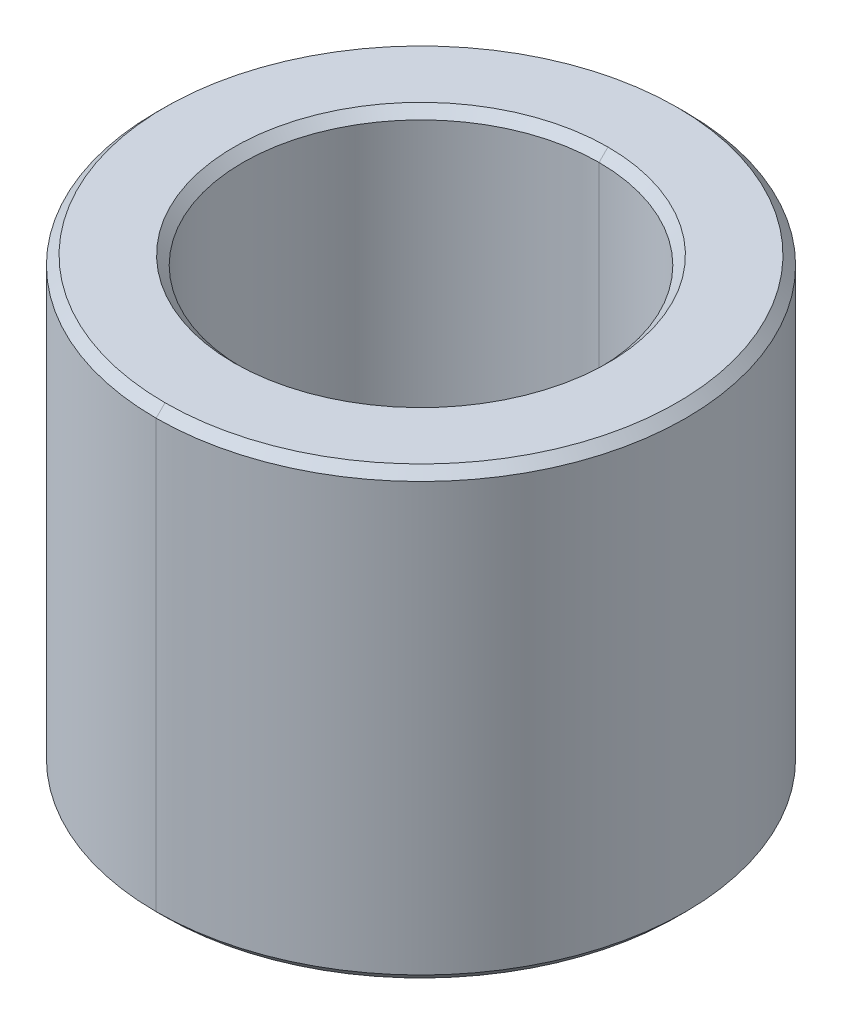
ISO-10303-21;
HEADER;
FILE_DESCRIPTION(('STEP AP214'),'2;1');
FILE_NAME('part.step','',(''),(''),'','','');
FILE_SCHEMA(('AUTOMOTIVE_DESIGN { 1 0 10303 214 1 1 1 1 }'));
ENDSEC;
DATA;
#1=APPLICATION_CONTEXT('core data for automotive mechanical design processes');
#2=APPLICATION_PROTOCOL_DEFINITION('international standard','automotive_design',2000,#1);
#3=PRODUCT_CONTEXT('',#1,'mechanical');
#4=PRODUCT('Part','Part','',(#3));
#5=PRODUCT_RELATED_PRODUCT_CATEGORY('part','',(#4));
#6=PRODUCT_DEFINITION_FORMATION('','',#4);
#7=PRODUCT_DEFINITION_CONTEXT('part definition',#1,'design');
#8=PRODUCT_DEFINITION('design','',#6,#7);
#9=PRODUCT_DEFINITION_SHAPE('','',#8);
#10=(LENGTH_UNIT() NAMED_UNIT(*) SI_UNIT(.MILLI.,.METRE.));
#11=(NAMED_UNIT(*) PLANE_ANGLE_UNIT() SI_UNIT($,.RADIAN.));
#12=(NAMED_UNIT(*) SI_UNIT($,.STERADIAN.) SOLID_ANGLE_UNIT());
#13=UNCERTAINTY_MEASURE_WITH_UNIT(LENGTH_MEASURE(1.E-05),#10,'distance_accuracy_value','');
#14=(GEOMETRIC_REPRESENTATION_CONTEXT(3) GLOBAL_UNCERTAINTY_ASSIGNED_CONTEXT((#13)) GLOBAL_UNIT_ASSIGNED_CONTEXT((#10,
#11,#12)) REPRESENTATION_CONTEXT('',''));
#15=CARTESIAN_POINT('',(0.,0.,0.));
#16=DIRECTION('',(0.,0.,1.));
#17=DIRECTION('',(1.,0.,0.));
#18=AXIS2_PLACEMENT_3D('',#15,#16,#17);
#19=CARTESIAN_POINT('',(0.,2.4,0.));
#20=DIRECTION('',(0.,1.,0.));
#21=DIRECTION('',(0.,0.,1.));
#22=AXIS2_PLACEMENT_3D('',#19,#20,#21);
#23=CONICAL_SURFACE('',#22,2.,0.78539816339745);
#24=DIRECTION('',(0.,0.707106781186546,-0.707106781186549));
#25=VECTOR('',#24,1.);
#26=CARTESIAN_POINT('',(0.,2.4,-2.));
#27=LINE('',#26,#25);
#28=CARTESIAN_POINT('',(0.,2.4,-2.));
#29=VERTEX_POINT('',#28);
#30=CARTESIAN_POINT('',(0.,2.5,-2.1));
#31=VERTEX_POINT('',#30);
#32=EDGE_CURVE('E134',#29,#31,#27,.T.);
#33=ORIENTED_EDGE('',*,*,#32,.F.);
#34=CARTESIAN_POINT('',(0.,2.4,0.));
#35=DIRECTION('',(0.,1.,0.));
#36=DIRECTION('',(0.,0.,1.));
#37=AXIS2_PLACEMENT_3D('',#34,#35,#36);
#38=CIRCLE('',#37,2.);
#39=CARTESIAN_POINT('',(0.,2.4,2.));
#40=VERTEX_POINT('',#39);
#41=EDGE_CURVE('E25',#40,#29,#38,.T.);
#42=ORIENTED_EDGE('',*,*,#41,.F.);
#43=DIRECTION('',(0.,0.707106781186546,0.707106781186549));
#44=VECTOR('',#43,1.);
#45=CARTESIAN_POINT('',(0.,2.4,2.));
#46=LINE('',#45,#44);
#47=CARTESIAN_POINT('',(0.,2.5,2.1));
#48=VERTEX_POINT('',#47);
#49=EDGE_CURVE('E125',#40,#48,#46,.T.);
#50=ORIENTED_EDGE('',*,*,#49,.T.);
#51=CARTESIAN_POINT('',(0.,2.5,0.));
#52=DIRECTION('',(0.,-1.,0.));
#53=DIRECTION('',(0.,0.,1.));
#54=AXIS2_PLACEMENT_3D('',#51,#52,#53);
#55=CIRCLE('',#54,2.1);
#56=EDGE_CURVE('E128',#31,#48,#55,.T.);
#57=ORIENTED_EDGE('',*,*,#56,.F.);
#58=EDGE_LOOP('',(#33,#42,#50,#57));
#59=FACE_BOUND('',#58,.T.);
#60=ADVANCED_FACE('F14',(#59),#23,.F.);
#61=CARTESIAN_POINT('',(0.,-2.5,0.));
#62=DIRECTION('',(0.,-1.,0.));
#63=DIRECTION('',(0.,0.,-1.));
#64=AXIS2_PLACEMENT_3D('',#61,#62,#63);
#65=CONICAL_SURFACE('',#64,2.1,0.78539816339744);
#66=DIRECTION('',(0.,-0.707106781186554,0.707106781186542));
#67=VECTOR('',#66,1.);
#68=CARTESIAN_POINT('',(0.,-2.5,2.1));
#69=LINE('',#68,#67);
#70=CARTESIAN_POINT('',(0.,-2.4,2.));
#71=VERTEX_POINT('',#70);
#72=CARTESIAN_POINT('',(0.,-2.5,2.1));
#73=VERTEX_POINT('',#72);
#74=EDGE_CURVE('E101',#71,#73,#69,.T.);
#75=ORIENTED_EDGE('',*,*,#74,.F.);
#76=CARTESIAN_POINT('',(0.,-2.4,0.));
#77=DIRECTION('',(0.,-1.,0.));
#78=DIRECTION('',(0.,0.,1.));
#79=AXIS2_PLACEMENT_3D('',#76,#77,#78);
#80=CIRCLE('',#79,2.);
#81=CARTESIAN_POINT('',(0.,-2.4,-2.));
#82=VERTEX_POINT('',#81);
#83=EDGE_CURVE('E9',#82,#71,#80,.T.);
#84=ORIENTED_EDGE('',*,*,#83,.F.);
#85=DIRECTION('',(0.,-0.707106781186554,-0.707106781186542));
#86=VECTOR('',#85,1.);
#87=CARTESIAN_POINT('',(0.,-2.5,-2.1));
#88=LINE('',#87,#86);
#89=CARTESIAN_POINT('',(0.,-2.5,-2.1));
#90=VERTEX_POINT('',#89);
#91=EDGE_CURVE('E104',#82,#90,#88,.T.);
#92=ORIENTED_EDGE('',*,*,#91,.T.);
#93=CARTESIAN_POINT('',(0.,-2.5,0.));
#94=DIRECTION('',(0.,1.,0.));
#95=DIRECTION('',(0.,0.,1.));
#96=AXIS2_PLACEMENT_3D('',#93,#94,#95);
#97=CIRCLE('',#96,2.1);
#98=EDGE_CURVE('E97',#73,#90,#97,.T.);
#99=ORIENTED_EDGE('',*,*,#98,.F.);
#100=EDGE_LOOP('',(#75,#84,#92,#99));
#101=FACE_BOUND('',#100,.T.);
#102=ADVANCED_FACE('F99',(#101),#65,.F.);
#103=CARTESIAN_POINT('',(0.,2.5,0.));
#104=DIRECTION('',(0.,-1.,0.));
#105=DIRECTION('',(0.,0.,-1.));
#106=AXIS2_PLACEMENT_3D('',#103,#104,#105);
#107=CONICAL_SURFACE('',#106,2.875,0.78539816339744);
#108=DIRECTION('',(0.,-0.707106781186554,0.707106781186542));
#109=VECTOR('',#108,1.);
#110=CARTESIAN_POINT('',(0.,2.5,2.875));
#111=LINE('',#110,#109);
#112=CARTESIAN_POINT('',(0.,2.5,2.875));
#113=VERTEX_POINT('',#112);
#114=CARTESIAN_POINT('',(0.,2.4,2.975));
#115=VERTEX_POINT('',#114);
#116=EDGE_CURVE('E151',#113,#115,#111,.T.);
#117=ORIENTED_EDGE('',*,*,#116,.F.);
#118=CARTESIAN_POINT('',(0.,2.5,0.));
#119=DIRECTION('',(0.,1.,0.));
#120=DIRECTION('',(0.,0.,1.));
#121=AXIS2_PLACEMENT_3D('',#118,#119,#120);
#122=CIRCLE('',#121,2.875);
#123=CARTESIAN_POINT('',(0.,2.5,-2.875));
#124=VERTEX_POINT('',#123);
#125=EDGE_CURVE('E144',#124,#113,#122,.T.);
#126=ORIENTED_EDGE('',*,*,#125,.F.);
#127=DIRECTION('',(0.,-0.707106781186554,-0.707106781186542));
#128=VECTOR('',#127,1.);
#129=CARTESIAN_POINT('',(0.,2.5,-2.875));
#130=LINE('',#129,#128);
#131=CARTESIAN_POINT('',(0.,2.4,-2.975));
#132=VERTEX_POINT('',#131);
#133=EDGE_CURVE('E154',#124,#132,#130,.T.);
#134=ORIENTED_EDGE('',*,*,#133,.T.);
#135=CARTESIAN_POINT('',(0.,2.4,0.));
#136=DIRECTION('',(0.,-1.,0.));
#137=DIRECTION('',(0.,0.,1.));
#138=AXIS2_PLACEMENT_3D('',#135,#136,#137);
#139=CIRCLE('',#138,2.975);
#140=EDGE_CURVE('E108',#115,#132,#139,.T.);
#141=ORIENTED_EDGE('',*,*,#140,.F.);
#142=EDGE_LOOP('',(#117,#126,#134,#141));
#143=FACE_BOUND('',#142,.T.);
#144=ADVANCED_FACE('F223',(#143),#107,.T.);
#145=CARTESIAN_POINT('',(0.,-2.4,0.));
#146=DIRECTION('',(0.,1.,0.));
#147=DIRECTION('',(0.,0.,1.));
#148=AXIS2_PLACEMENT_3D('',#145,#146,#147);
#149=CONICAL_SURFACE('',#148,2.975,0.785398163397446);
#150=DIRECTION('',(0.,0.707106781186549,-0.707106781186546));
#151=VECTOR('',#150,1.);
#152=CARTESIAN_POINT('',(0.,-2.4,-2.975));
#153=LINE('',#152,#151);
#154=CARTESIAN_POINT('',(0.,-2.5,-2.875));
#155=VERTEX_POINT('',#154);
#156=CARTESIAN_POINT('',(0.,-2.4,-2.975));
#157=VERTEX_POINT('',#156);
#158=EDGE_CURVE('E184',#155,#157,#153,.T.);
#159=ORIENTED_EDGE('',*,*,#158,.F.);
#160=CARTESIAN_POINT('',(0.,-2.5,0.));
#161=DIRECTION('',(0.,-1.,0.));
#162=DIRECTION('',(0.,0.,1.));
#163=AXIS2_PLACEMENT_3D('',#160,#161,#162);
#164=CIRCLE('',#163,2.875);
#165=CARTESIAN_POINT('',(0.,-2.5,2.875));
#166=VERTEX_POINT('',#165);
#167=EDGE_CURVE('E109',#166,#155,#164,.T.);
#168=ORIENTED_EDGE('',*,*,#167,.F.);
#169=DIRECTION('',(0.,0.707106781186549,0.707106781186546));
#170=VECTOR('',#169,1.);
#171=CARTESIAN_POINT('',(0.,-2.4,2.975));
#172=LINE('',#171,#170);
#173=CARTESIAN_POINT('',(0.,-2.4,2.975));
#174=VERTEX_POINT('',#173);
#175=EDGE_CURVE('E173',#166,#174,#172,.T.);
#176=ORIENTED_EDGE('',*,*,#175,.T.);
#177=CARTESIAN_POINT('',(0.,-2.4,0.));
#178=DIRECTION('',(0.,1.,0.));
#179=DIRECTION('',(0.,0.,1.));
#180=AXIS2_PLACEMENT_3D('',#177,#178,#179);
#181=CIRCLE('',#180,2.975);
#182=EDGE_CURVE('E40',#157,#174,#181,.T.);
#183=ORIENTED_EDGE('',*,*,#182,.F.);
#184=EDGE_LOOP('',(#159,#168,#176,#183));
#185=FACE_BOUND('',#184,.T.);
#186=ADVANCED_FACE('F240',(#185),#149,.T.);
#187=CARTESIAN_POINT('',(0.,2.5,0.));
#188=DIRECTION('',(0.,-1.,0.));
#189=DIRECTION('',(0.,0.,-1.));
#190=AXIS2_PLACEMENT_3D('',#187,#188,#189);
#191=CYLINDRICAL_SURFACE('',#190,2.);
#192=DIRECTION('',(0.,-1.,0.));
#193=VECTOR('',#192,1.);
#194=CARTESIAN_POINT('',(0.,2.5,2.));
#195=LINE('',#194,#193);
#196=EDGE_CURVE('E177',#40,#71,#195,.T.);
#197=ORIENTED_EDGE('',*,*,#196,.F.);
#198=ORIENTED_EDGE('',*,*,#41,.T.);
#199=DIRECTION('',(0.,-1.,0.));
#200=VECTOR('',#199,1.);
#201=CARTESIAN_POINT('',(0.,2.5,-2.));
#202=LINE('',#201,#200);
#203=EDGE_CURVE('E139',#29,#82,#202,.T.);
#204=ORIENTED_EDGE('',*,*,#203,.T.);
#205=ORIENTED_EDGE('',*,*,#83,.T.);
#206=EDGE_LOOP('',(#197,#198,#204,#205));
#207=FACE_BOUND('',#206,.T.);
#208=ADVANCED_FACE('F205',(#207),#191,.F.);
#209=CARTESIAN_POINT('',(0.,2.5,0.));
#210=DIRECTION('',(0.,-1.,0.));
#211=DIRECTION('',(0.,0.,-1.));
#212=AXIS2_PLACEMENT_3D('',#209,#210,#211);
#213=CYLINDRICAL_SURFACE('',#212,2.975);
#214=DIRECTION('',(0.,-1.,0.));
#215=VECTOR('',#214,1.);
#216=CARTESIAN_POINT('',(0.,2.5,2.975));
#217=LINE('',#216,#215);
#218=EDGE_CURVE('E135',#115,#174,#217,.T.);
#219=ORIENTED_EDGE('',*,*,#218,.F.);
#220=ORIENTED_EDGE('',*,*,#140,.T.);
#221=DIRECTION('',(0.,-1.,0.));
#222=VECTOR('',#221,1.);
#223=CARTESIAN_POINT('',(0.,2.5,-2.975));
#224=LINE('',#223,#222);
#225=EDGE_CURVE('E138',#132,#157,#224,.T.);
#226=ORIENTED_EDGE('',*,*,#225,.T.);
#227=ORIENTED_EDGE('',*,*,#182,.T.);
#228=EDGE_LOOP('',(#219,#220,#226,#227));
#229=FACE_BOUND('',#228,.T.);
#230=ADVANCED_FACE('F231',(#229),#213,.T.);
#231=CARTESIAN_POINT('',(0.,-2.5,0.));
#232=DIRECTION('',(0.,1.,0.));
#233=DIRECTION('',(1.,0.,0.));
#234=AXIS2_PLACEMENT_3D('',#231,#232,#233);
#235=PLANE('',#234);
#236=CARTESIAN_POINT('',(0.,-2.5,0.));
#237=DIRECTION('',(0.,1.,0.));
#238=DIRECTION('',(0.,0.,1.));
#239=AXIS2_PLACEMENT_3D('',#236,#237,#238);
#240=CIRCLE('',#239,2.1);
#241=EDGE_CURVE('E110',#90,#73,#240,.T.);
#242=ORIENTED_EDGE('',*,*,#241,.T.);
#243=ORIENTED_EDGE('',*,*,#98,.T.);
#244=EDGE_LOOP('',(#242,#243));
#245=FACE_BOUND('',#244,.T.);
#246=ORIENTED_EDGE('',*,*,#167,.T.);
#247=CARTESIAN_POINT('',(0.,-2.5,0.));
#248=DIRECTION('',(0.,-1.,0.));
#249=DIRECTION('',(0.,0.,1.));
#250=AXIS2_PLACEMENT_3D('',#247,#248,#249);
#251=CIRCLE('',#250,2.875);
#252=EDGE_CURVE('E158',#155,#166,#251,.T.);
#253=ORIENTED_EDGE('',*,*,#252,.T.);
#254=EDGE_LOOP('',(#246,#253));
#255=FACE_BOUND('',#254,.T.);
#256=ADVANCED_FACE('F111',(#245,#255),#235,.F.);
#257=CARTESIAN_POINT('',(0.,2.5,0.));
#258=DIRECTION('',(0.,1.,0.));
#259=DIRECTION('',(1.,0.,0.));
#260=AXIS2_PLACEMENT_3D('',#257,#258,#259);
#261=PLANE('',#260);
#262=CARTESIAN_POINT('',(0.,2.5,0.));
#263=DIRECTION('',(0.,-1.,0.));
#264=DIRECTION('',(0.,0.,1.));
#265=AXIS2_PLACEMENT_3D('',#262,#263,#264);
#266=CIRCLE('',#265,2.1);
#267=EDGE_CURVE('E140',#48,#31,#266,.T.);
#268=ORIENTED_EDGE('',*,*,#267,.T.);
#269=ORIENTED_EDGE('',*,*,#56,.T.);
#270=EDGE_LOOP('',(#268,#269));
#271=FACE_BOUND('',#270,.T.);
#272=ORIENTED_EDGE('',*,*,#125,.T.);
#273=CARTESIAN_POINT('',(0.,2.5,0.));
#274=DIRECTION('',(0.,1.,0.));
#275=DIRECTION('',(0.,0.,1.));
#276=AXIS2_PLACEMENT_3D('',#273,#274,#275);
#277=CIRCLE('',#276,2.875);
#278=EDGE_CURVE('E147',#113,#124,#277,.T.);
#279=ORIENTED_EDGE('',*,*,#278,.T.);
#280=EDGE_LOOP('',(#272,#279));
#281=FACE_BOUND('',#280,.T.);
#282=ADVANCED_FACE('F216',(#271,#281),#261,.T.);
#283=CARTESIAN_POINT('',(0.,2.5,0.));
#284=DIRECTION('',(0.,-1.,0.));
#285=DIRECTION('',(0.,0.,-1.));
#286=AXIS2_PLACEMENT_3D('',#283,#284,#285);
#287=CYLINDRICAL_SURFACE('',#286,2.975);
#288=CARTESIAN_POINT('',(0.,2.4,0.));
#289=DIRECTION('',(0.,-1.,0.));
#290=DIRECTION('',(0.,0.,1.));
#291=AXIS2_PLACEMENT_3D('',#288,#289,#290);
#292=CIRCLE('',#291,2.975);
#293=EDGE_CURVE('E159',#132,#115,#292,.T.);
#294=ORIENTED_EDGE('',*,*,#293,.T.);
#295=ORIENTED_EDGE('',*,*,#218,.T.);
#296=CARTESIAN_POINT('',(0.,-2.4,0.));
#297=DIRECTION('',(0.,1.,0.));
#298=DIRECTION('',(0.,0.,1.));
#299=AXIS2_PLACEMENT_3D('',#296,#297,#298);
#300=CIRCLE('',#299,2.975);
#301=EDGE_CURVE('E18',#174,#157,#300,.T.);
#302=ORIENTED_EDGE('',*,*,#301,.T.);
#303=ORIENTED_EDGE('',*,*,#225,.F.);
#304=EDGE_LOOP('',(#294,#295,#302,#303));
#305=FACE_BOUND('',#304,.T.);
#306=ADVANCED_FACE('F16',(#305),#287,.T.);
#307=CARTESIAN_POINT('',(0.,2.5,0.));
#308=DIRECTION('',(0.,-1.,0.));
#309=DIRECTION('',(0.,0.,-1.));
#310=AXIS2_PLACEMENT_3D('',#307,#308,#309);
#311=CYLINDRICAL_SURFACE('',#310,2.);
#312=CARTESIAN_POINT('',(0.,2.4,0.));
#313=DIRECTION('',(0.,1.,0.));
#314=DIRECTION('',(0.,0.,1.));
#315=AXIS2_PLACEMENT_3D('',#312,#313,#314);
#316=CIRCLE('',#315,2.);
#317=EDGE_CURVE('E130',#29,#40,#316,.T.);
#318=ORIENTED_EDGE('',*,*,#317,.T.);
#319=ORIENTED_EDGE('',*,*,#196,.T.);
#320=CARTESIAN_POINT('',(0.,-2.4,0.));
#321=DIRECTION('',(0.,-1.,0.));
#322=DIRECTION('',(0.,0.,1.));
#323=AXIS2_PLACEMENT_3D('',#320,#321,#322);
#324=CIRCLE('',#323,2.);
#325=EDGE_CURVE('E118',#71,#82,#324,.T.);
#326=ORIENTED_EDGE('',*,*,#325,.T.);
#327=ORIENTED_EDGE('',*,*,#203,.F.);
#328=EDGE_LOOP('',(#318,#319,#326,#327));
#329=FACE_BOUND('',#328,.T.);
#330=ADVANCED_FACE('F208',(#329),#311,.F.);
#331=CARTESIAN_POINT('',(0.,-2.4,0.));
#332=DIRECTION('',(0.,1.,0.));
#333=DIRECTION('',(0.,0.,1.));
#334=AXIS2_PLACEMENT_3D('',#331,#332,#333);
#335=CONICAL_SURFACE('',#334,2.975,0.785398163397446);
#336=ORIENTED_EDGE('',*,*,#252,.F.);
#337=ORIENTED_EDGE('',*,*,#158,.T.);
#338=ORIENTED_EDGE('',*,*,#301,.F.);
#339=ORIENTED_EDGE('',*,*,#175,.F.);
#340=EDGE_LOOP('',(#336,#337,#338,#339));
#341=FACE_BOUND('',#340,.T.);
#342=ADVANCED_FACE('F254',(#341),#335,.T.);
#343=CARTESIAN_POINT('',(0.,2.5,0.));
#344=DIRECTION('',(0.,-1.,0.));
#345=DIRECTION('',(0.,0.,-1.));
#346=AXIS2_PLACEMENT_3D('',#343,#344,#345);
#347=CONICAL_SURFACE('',#346,2.875,0.78539816339744);
#348=ORIENTED_EDGE('',*,*,#278,.F.);
#349=ORIENTED_EDGE('',*,*,#116,.T.);
#350=ORIENTED_EDGE('',*,*,#293,.F.);
#351=ORIENTED_EDGE('',*,*,#133,.F.);
#352=EDGE_LOOP('',(#348,#349,#350,#351));
#353=FACE_BOUND('',#352,.T.);
#354=ADVANCED_FACE('F226',(#353),#347,.T.);
#355=CARTESIAN_POINT('',(0.,-2.5,0.));
#356=DIRECTION('',(0.,-1.,0.));
#357=DIRECTION('',(0.,0.,-1.));
#358=AXIS2_PLACEMENT_3D('',#355,#356,#357);
#359=CONICAL_SURFACE('',#358,2.1,0.78539816339744);
#360=ORIENTED_EDGE('',*,*,#325,.F.);
#361=ORIENTED_EDGE('',*,*,#74,.T.);
#362=ORIENTED_EDGE('',*,*,#241,.F.);
#363=ORIENTED_EDGE('',*,*,#91,.F.);
#364=EDGE_LOOP('',(#360,#361,#362,#363));
#365=FACE_BOUND('',#364,.T.);
#366=ADVANCED_FACE('F116',(#365),#359,.F.);
#367=CARTESIAN_POINT('',(0.,2.4,0.));
#368=DIRECTION('',(0.,1.,0.));
#369=DIRECTION('',(0.,0.,1.));
#370=AXIS2_PLACEMENT_3D('',#367,#368,#369);
#371=CONICAL_SURFACE('',#370,2.,0.78539816339745);
#372=ORIENTED_EDGE('',*,*,#317,.F.);
#373=ORIENTED_EDGE('',*,*,#32,.T.);
#374=ORIENTED_EDGE('',*,*,#267,.F.);
#375=ORIENTED_EDGE('',*,*,#49,.F.);
#376=EDGE_LOOP('',(#372,#373,#374,#375));
#377=FACE_BOUND('',#376,.T.);
#378=ADVANCED_FACE('F213',(#377),#371,.F.);
#379=CLOSED_SHELL('',(#60,#102,#144,#186,#208,#230,#256,#282,#306,#330,#342,#354,#366,#378));
#380=MANIFOLD_SOLID_BREP('B1',#379);
#381=ADVANCED_BREP_SHAPE_REPRESENTATION('',(#18,#380),#14);
#382=SHAPE_DEFINITION_REPRESENTATION(#9,#381);
ENDSEC;
END-ISO-10303-21;
